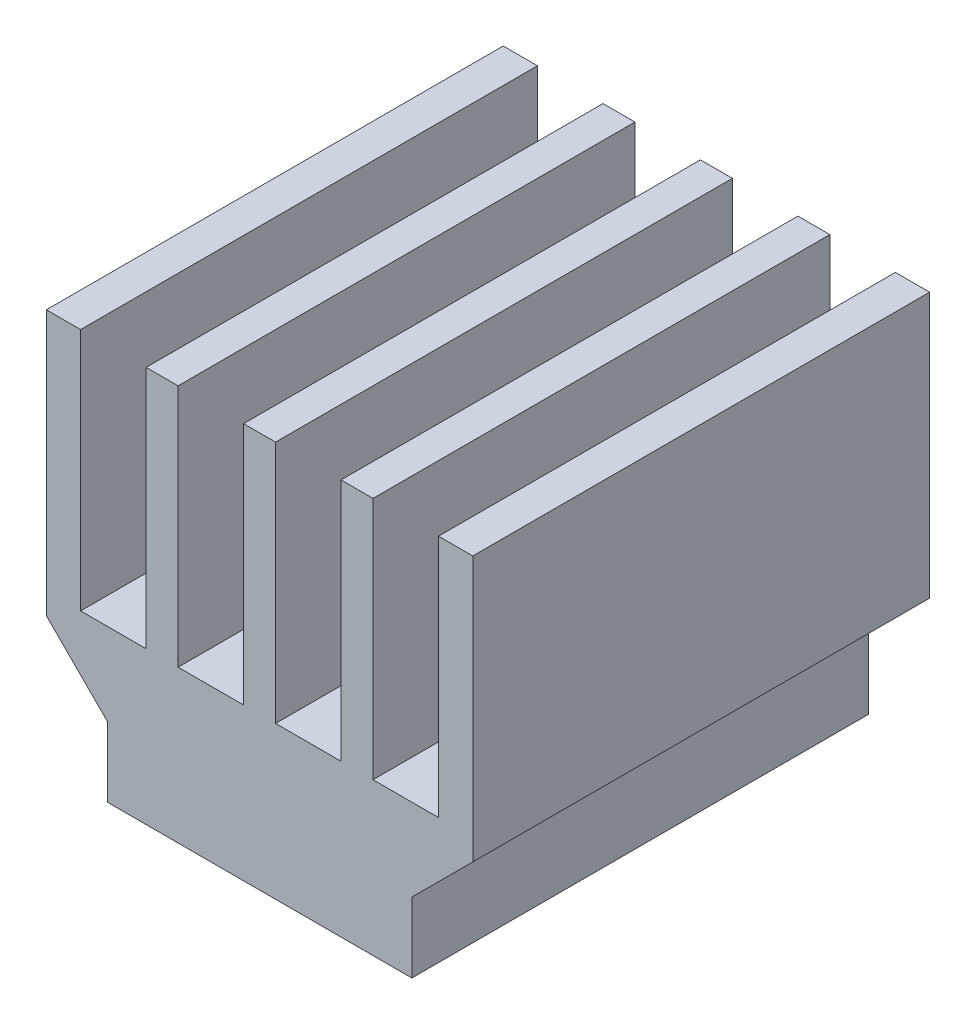
ISO-10303-21;
HEADER;
FILE_DESCRIPTION(('STEP AP214'),'2;1');
FILE_NAME('part.step','',(''),(''),'','','');
FILE_SCHEMA(('AUTOMOTIVE_DESIGN { 1 0 10303 214 1 1 1 1 }'));
ENDSEC;
DATA;
#1=APPLICATION_CONTEXT('core data for automotive mechanical design processes');
#2=APPLICATION_PROTOCOL_DEFINITION('international standard','automotive_design',2000,#1);
#3=PRODUCT_CONTEXT('',#1,'mechanical');
#4=PRODUCT('Part','Part','',(#3));
#5=PRODUCT_RELATED_PRODUCT_CATEGORY('part','',(#4));
#6=PRODUCT_DEFINITION_FORMATION('','',#4);
#7=PRODUCT_DEFINITION_CONTEXT('part definition',#1,'design');
#8=PRODUCT_DEFINITION('design','',#6,#7);
#9=PRODUCT_DEFINITION_SHAPE('','',#8);
#10=(LENGTH_UNIT() NAMED_UNIT(*) SI_UNIT(.MILLI.,.METRE.));
#11=(NAMED_UNIT(*) PLANE_ANGLE_UNIT() SI_UNIT($,.RADIAN.));
#12=(NAMED_UNIT(*) SI_UNIT($,.STERADIAN.) SOLID_ANGLE_UNIT());
#13=UNCERTAINTY_MEASURE_WITH_UNIT(LENGTH_MEASURE(1.E-05),#10,'distance_accuracy_value','');
#14=(GEOMETRIC_REPRESENTATION_CONTEXT(3) GLOBAL_UNCERTAINTY_ASSIGNED_CONTEXT((#13)) GLOBAL_UNIT_ASSIGNED_CONTEXT((#10,
#11,#12)) REPRESENTATION_CONTEXT('',''));
#15=CARTESIAN_POINT('',(0.,0.,0.));
#16=DIRECTION('',(0.,0.,1.));
#17=DIRECTION('',(1.,0.,0.));
#18=AXIS2_PLACEMENT_3D('',#15,#16,#17);
#19=CARTESIAN_POINT('',(-7.,0.,15.));
#20=DIRECTION('',(1.,0.,0.));
#21=DIRECTION('',(0.,1.,0.));
#22=AXIS2_PLACEMENT_3D('',#19,#20,#21);
#23=PLANE('',#22);
#24=DIRECTION('',(0.,-1.,0.));
#25=VECTOR('',#24,1.);
#26=CARTESIAN_POINT('',(-7.,0.,0.));
#27=LINE('',#26,#25);
#28=CARTESIAN_POINT('',(-7.,13.,0.));
#29=VERTEX_POINT('',#28);
#30=CARTESIAN_POINT('',(-7.,4.3,0.));
#31=VERTEX_POINT('',#30);
#32=EDGE_CURVE('E233',#29,#31,#27,.T.);
#33=ORIENTED_EDGE('',*,*,#32,.T.);
#34=DIRECTION('',(0.,0.,-1.));
#35=VECTOR('',#34,1.);
#36=CARTESIAN_POINT('',(-7.,4.3,15.));
#37=LINE('',#36,#35);
#38=CARTESIAN_POINT('',(-7.,4.3,15.));
#39=VERTEX_POINT('',#38);
#40=EDGE_CURVE('E11',#39,#31,#37,.T.);
#41=ORIENTED_EDGE('',*,*,#40,.F.);
#42=DIRECTION('',(0.,-1.,0.));
#43=VECTOR('',#42,1.);
#44=CARTESIAN_POINT('',(-7.,0.,15.));
#45=LINE('',#44,#43);
#46=CARTESIAN_POINT('',(-7.,13.,15.));
#47=VERTEX_POINT('',#46);
#48=EDGE_CURVE('E424',#47,#39,#45,.T.);
#49=ORIENTED_EDGE('',*,*,#48,.F.);
#50=DIRECTION('',(0.,0.,-1.));
#51=VECTOR('',#50,1.);
#52=CARTESIAN_POINT('',(-7.,13.,15.));
#53=LINE('',#52,#51);
#54=EDGE_CURVE('E52',#47,#29,#53,.T.);
#55=ORIENTED_EDGE('',*,*,#54,.T.);
#56=EDGE_LOOP('',(#33,#41,#49,#55));
#57=FACE_BOUND('',#56,.T.);
#58=ADVANCED_FACE('F36',(#57),#23,.F.);
#59=CARTESIAN_POINT('',(-1.34999999999999,-1.34999999999999,15.));
#60=DIRECTION('',(0.707106781186546,0.707106781186549,0.));
#61=DIRECTION('',(-0.707106781186549,0.707106781186546,0.));
#62=AXIS2_PLACEMENT_3D('',#59,#60,#61);
#63=PLANE('',#62);
#64=DIRECTION('',(0.707106781186549,-0.707106781186546,0.));
#65=VECTOR('',#64,1.);
#66=CARTESIAN_POINT('',(-1.34999999999999,-1.34999999999999,0.));
#67=LINE('',#66,#65);
#68=CARTESIAN_POINT('',(-5.,2.30000000000001,0.));
#69=VERTEX_POINT('',#68);
#70=EDGE_CURVE('E235',#31,#69,#67,.T.);
#71=ORIENTED_EDGE('',*,*,#70,.T.);
#72=DIRECTION('',(0.,0.,-1.));
#73=VECTOR('',#72,1.);
#74=CARTESIAN_POINT('',(-5.,2.30000000000001,15.));
#75=LINE('',#74,#73);
#76=CARTESIAN_POINT('',(-5.,2.30000000000001,15.));
#77=VERTEX_POINT('',#76);
#78=EDGE_CURVE('E44',#77,#69,#75,.T.);
#79=ORIENTED_EDGE('',*,*,#78,.F.);
#80=DIRECTION('',(0.707106781186549,-0.707106781186546,0.));
#81=VECTOR('',#80,1.);
#82=CARTESIAN_POINT('',(-1.34999999999999,-1.34999999999999,15.));
#83=LINE('',#82,#81);
#84=EDGE_CURVE('E138',#39,#77,#83,.T.);
#85=ORIENTED_EDGE('',*,*,#84,.F.);
#86=ORIENTED_EDGE('',*,*,#40,.T.);
#87=EDGE_LOOP('',(#71,#79,#85,#86));
#88=FACE_BOUND('',#87,.T.);
#89=ADVANCED_FACE('F427',(#88),#63,.F.);
#90=CARTESIAN_POINT('',(-5.,0.,15.));
#91=DIRECTION('',(1.,0.,0.));
#92=DIRECTION('',(0.,1.,0.));
#93=AXIS2_PLACEMENT_3D('',#90,#91,#92);
#94=PLANE('',#93);
#95=DIRECTION('',(0.,-1.,0.));
#96=VECTOR('',#95,1.);
#97=CARTESIAN_POINT('',(-5.,0.,0.));
#98=LINE('',#97,#96);
#99=CARTESIAN_POINT('',(-5.,0.,0.));
#100=VERTEX_POINT('',#99);
#101=EDGE_CURVE('E237',#69,#100,#98,.T.);
#102=ORIENTED_EDGE('',*,*,#101,.T.);
#103=DIRECTION('',(0.,0.,-1.));
#104=VECTOR('',#103,1.);
#105=CARTESIAN_POINT('',(-5.,0.,15.));
#106=LINE('',#105,#104);
#107=CARTESIAN_POINT('',(-5.,0.,15.));
#108=VERTEX_POINT('',#107);
#109=EDGE_CURVE('E335',#108,#100,#106,.T.);
#110=ORIENTED_EDGE('',*,*,#109,.F.);
#111=DIRECTION('',(0.,-1.,0.));
#112=VECTOR('',#111,1.);
#113=CARTESIAN_POINT('',(-5.,0.,15.));
#114=LINE('',#113,#112);
#115=EDGE_CURVE('E343',#77,#108,#114,.T.);
#116=ORIENTED_EDGE('',*,*,#115,.F.);
#117=ORIENTED_EDGE('',*,*,#78,.T.);
#118=EDGE_LOOP('',(#102,#110,#116,#117));
#119=FACE_BOUND('',#118,.T.);
#120=ADVANCED_FACE('F341',(#119),#94,.F.);
#121=CARTESIAN_POINT('',(0.,0.,15.));
#122=DIRECTION('',(0.,1.,0.));
#123=DIRECTION('',(0.,0.,1.));
#124=AXIS2_PLACEMENT_3D('',#121,#122,#123);
#125=PLANE('',#124);
#126=DIRECTION('',(1.,0.,0.));
#127=VECTOR('',#126,1.);
#128=CARTESIAN_POINT('',(0.,0.,0.));
#129=LINE('',#128,#127);
#130=CARTESIAN_POINT('',(5.,0.,0.));
#131=VERTEX_POINT('',#130);
#132=EDGE_CURVE('E240',#100,#131,#129,.T.);
#133=ORIENTED_EDGE('',*,*,#132,.T.);
#134=DIRECTION('',(0.,0.,-1.));
#135=VECTOR('',#134,1.);
#136=CARTESIAN_POINT('',(5.,0.,15.));
#137=LINE('',#136,#135);
#138=CARTESIAN_POINT('',(5.,0.,15.));
#139=VERTEX_POINT('',#138);
#140=EDGE_CURVE('E332',#139,#131,#137,.T.);
#141=ORIENTED_EDGE('',*,*,#140,.F.);
#142=DIRECTION('',(1.,0.,0.));
#143=VECTOR('',#142,1.);
#144=CARTESIAN_POINT('',(0.,0.,15.));
#145=LINE('',#144,#143);
#146=EDGE_CURVE('E353',#108,#139,#145,.T.);
#147=ORIENTED_EDGE('',*,*,#146,.F.);
#148=ORIENTED_EDGE('',*,*,#109,.T.);
#149=EDGE_LOOP('',(#133,#141,#147,#148));
#150=FACE_BOUND('',#149,.T.);
#151=ADVANCED_FACE('F350',(#150),#125,.F.);
#152=CARTESIAN_POINT('',(5.,0.,15.));
#153=DIRECTION('',(1.,0.,0.));
#154=DIRECTION('',(0.,1.,0.));
#155=AXIS2_PLACEMENT_3D('',#152,#153,#154);
#156=PLANE('',#155);
#157=DIRECTION('',(0.,-1.,0.));
#158=VECTOR('',#157,1.);
#159=CARTESIAN_POINT('',(5.,0.,0.));
#160=LINE('',#159,#158);
#161=CARTESIAN_POINT('',(5.,2.30000000000001,0.));
#162=VERTEX_POINT('',#161);
#163=EDGE_CURVE('E243',#162,#131,#160,.T.);
#164=ORIENTED_EDGE('',*,*,#163,.F.);
#165=DIRECTION('',(0.,0.,-1.));
#166=VECTOR('',#165,1.);
#167=CARTESIAN_POINT('',(5.,2.30000000000001,15.));
#168=LINE('',#167,#166);
#169=CARTESIAN_POINT('',(5.,2.30000000000001,15.));
#170=VERTEX_POINT('',#169);
#171=EDGE_CURVE('E330',#170,#162,#168,.T.);
#172=ORIENTED_EDGE('',*,*,#171,.F.);
#173=DIRECTION('',(0.,-1.,0.));
#174=VECTOR('',#173,1.);
#175=CARTESIAN_POINT('',(5.,0.,15.));
#176=LINE('',#175,#174);
#177=EDGE_CURVE('E356',#170,#139,#176,.T.);
#178=ORIENTED_EDGE('',*,*,#177,.T.);
#179=ORIENTED_EDGE('',*,*,#140,.T.);
#180=EDGE_LOOP('',(#164,#172,#178,#179));
#181=FACE_BOUND('',#180,.T.);
#182=ADVANCED_FACE('F437',(#181),#156,.T.);
#183=CARTESIAN_POINT('',(1.34999999999999,-1.34999999999999,15.));
#184=DIRECTION('',(0.707106781186546,-0.707106781186549,0.));
#185=DIRECTION('',(0.707106781186549,0.707106781186546,0.));
#186=AXIS2_PLACEMENT_3D('',#183,#184,#185);
#187=PLANE('',#186);
#188=DIRECTION('',(-0.707106781186549,-0.707106781186546,0.));
#189=VECTOR('',#188,1.);
#190=CARTESIAN_POINT('',(1.34999999999999,-1.34999999999999,0.));
#191=LINE('',#190,#189);
#192=CARTESIAN_POINT('',(7.,4.3,0.));
#193=VERTEX_POINT('',#192);
#194=EDGE_CURVE('E246',#193,#162,#191,.T.);
#195=ORIENTED_EDGE('',*,*,#194,.F.);
#196=DIRECTION('',(0.,0.,-1.));
#197=VECTOR('',#196,1.);
#198=CARTESIAN_POINT('',(7.,4.3,15.));
#199=LINE('',#198,#197);
#200=CARTESIAN_POINT('',(7.,4.3,15.));
#201=VERTEX_POINT('',#200);
#202=EDGE_CURVE('E327',#201,#193,#199,.T.);
#203=ORIENTED_EDGE('',*,*,#202,.F.);
#204=DIRECTION('',(-0.707106781186549,-0.707106781186546,0.));
#205=VECTOR('',#204,1.);
#206=CARTESIAN_POINT('',(1.34999999999999,-1.34999999999999,15.));
#207=LINE('',#206,#205);
#208=EDGE_CURVE('E360',#201,#170,#207,.T.);
#209=ORIENTED_EDGE('',*,*,#208,.T.);
#210=ORIENTED_EDGE('',*,*,#171,.T.);
#211=EDGE_LOOP('',(#195,#203,#209,#210));
#212=FACE_BOUND('',#211,.T.);
#213=ADVANCED_FACE('F440',(#212),#187,.T.);
#214=CARTESIAN_POINT('',(7.,0.,15.));
#215=DIRECTION('',(1.,0.,0.));
#216=DIRECTION('',(0.,1.,0.));
#217=AXIS2_PLACEMENT_3D('',#214,#215,#216);
#218=PLANE('',#217);
#219=DIRECTION('',(0.,-1.,0.));
#220=VECTOR('',#219,1.);
#221=CARTESIAN_POINT('',(7.,0.,0.));
#222=LINE('',#221,#220);
#223=CARTESIAN_POINT('',(7.,13.,0.));
#224=VERTEX_POINT('',#223);
#225=EDGE_CURVE('E249',#224,#193,#222,.T.);
#226=ORIENTED_EDGE('',*,*,#225,.F.);
#227=DIRECTION('',(0.,0.,-1.));
#228=VECTOR('',#227,1.);
#229=CARTESIAN_POINT('',(7.,13.,15.));
#230=LINE('',#229,#228);
#231=CARTESIAN_POINT('',(7.,13.,15.));
#232=VERTEX_POINT('',#231);
#233=EDGE_CURVE('E325',#232,#224,#230,.T.);
#234=ORIENTED_EDGE('',*,*,#233,.F.);
#235=DIRECTION('',(0.,-1.,0.));
#236=VECTOR('',#235,1.);
#237=CARTESIAN_POINT('',(7.,0.,15.));
#238=LINE('',#237,#236);
#239=EDGE_CURVE('E367',#232,#201,#238,.T.);
#240=ORIENTED_EDGE('',*,*,#239,.T.);
#241=ORIENTED_EDGE('',*,*,#202,.T.);
#242=EDGE_LOOP('',(#226,#234,#240,#241));
#243=FACE_BOUND('',#242,.T.);
#244=ADVANCED_FACE('F444',(#243),#218,.T.);
#245=CARTESIAN_POINT('',(0.,13.,15.));
#246=DIRECTION('',(0.,1.,0.));
#247=DIRECTION('',(0.,0.,1.));
#248=AXIS2_PLACEMENT_3D('',#245,#246,#247);
#249=PLANE('',#248);
#250=DIRECTION('',(1.,0.,0.));
#251=VECTOR('',#250,1.);
#252=CARTESIAN_POINT('',(0.,13.,0.));
#253=LINE('',#252,#251);
#254=CARTESIAN_POINT('',(5.875,13.,0.));
#255=VERTEX_POINT('',#254);
#256=EDGE_CURVE('E253',#255,#224,#253,.T.);
#257=ORIENTED_EDGE('',*,*,#256,.F.);
#258=DIRECTION('',(0.,0.,-1.));
#259=VECTOR('',#258,1.);
#260=CARTESIAN_POINT('',(5.875,13.,15.));
#261=LINE('',#260,#259);
#262=CARTESIAN_POINT('',(5.875,13.,15.));
#263=VERTEX_POINT('',#262);
#264=EDGE_CURVE('E323',#263,#255,#261,.T.);
#265=ORIENTED_EDGE('',*,*,#264,.F.);
#266=DIRECTION('',(1.,0.,0.));
#267=VECTOR('',#266,1.);
#268=CARTESIAN_POINT('',(0.,13.,15.));
#269=LINE('',#268,#267);
#270=EDGE_CURVE('E230',#263,#232,#269,.T.);
#271=ORIENTED_EDGE('',*,*,#270,.T.);
#272=ORIENTED_EDGE('',*,*,#233,.T.);
#273=EDGE_LOOP('',(#257,#265,#271,#272));
#274=FACE_BOUND('',#273,.T.);
#275=ADVANCED_FACE('F448',(#274),#249,.T.);
#276=CARTESIAN_POINT('',(5.875,0.,15.));
#277=DIRECTION('',(1.,0.,0.));
#278=DIRECTION('',(0.,1.,0.));
#279=AXIS2_PLACEMENT_3D('',#276,#277,#278);
#280=PLANE('',#279);
#281=DIRECTION('',(0.,-1.,0.));
#282=VECTOR('',#281,1.);
#283=CARTESIAN_POINT('',(5.875,0.,0.));
#284=LINE('',#283,#282);
#285=CARTESIAN_POINT('',(5.875,5.,0.));
#286=VERTEX_POINT('',#285);
#287=EDGE_CURVE('E256',#255,#286,#284,.T.);
#288=ORIENTED_EDGE('',*,*,#287,.T.);
#289=DIRECTION('',(0.,0.,-1.));
#290=VECTOR('',#289,1.);
#291=CARTESIAN_POINT('',(5.875,5.,15.));
#292=LINE('',#291,#290);
#293=CARTESIAN_POINT('',(5.875,5.,15.));
#294=VERTEX_POINT('',#293);
#295=EDGE_CURVE('E320',#294,#286,#292,.T.);
#296=ORIENTED_EDGE('',*,*,#295,.F.);
#297=DIRECTION('',(0.,-1.,0.));
#298=VECTOR('',#297,1.);
#299=CARTESIAN_POINT('',(5.875,0.,15.));
#300=LINE('',#299,#298);
#301=EDGE_CURVE('E371',#263,#294,#300,.T.);
#302=ORIENTED_EDGE('',*,*,#301,.F.);
#303=ORIENTED_EDGE('',*,*,#264,.T.);
#304=EDGE_LOOP('',(#288,#296,#302,#303));
#305=FACE_BOUND('',#304,.T.);
#306=ADVANCED_FACE('F450',(#305),#280,.F.);
#307=CARTESIAN_POINT('',(0.,5.,15.));
#308=DIRECTION('',(0.,1.,0.));
#309=DIRECTION('',(0.,0.,1.));
#310=AXIS2_PLACEMENT_3D('',#307,#308,#309);
#311=PLANE('',#310);
#312=DIRECTION('',(1.,0.,0.));
#313=VECTOR('',#312,1.);
#314=CARTESIAN_POINT('',(0.,5.,0.));
#315=LINE('',#314,#313);
#316=CARTESIAN_POINT('',(3.725,5.,0.));
#317=VERTEX_POINT('',#316);
#318=EDGE_CURVE('E261',#317,#286,#315,.T.);
#319=ORIENTED_EDGE('',*,*,#318,.F.);
#320=DIRECTION('',(0.,0.,-1.));
#321=VECTOR('',#320,1.);
#322=CARTESIAN_POINT('',(3.725,5.,15.));
#323=LINE('',#322,#321);
#324=CARTESIAN_POINT('',(3.725,5.,15.));
#325=VERTEX_POINT('',#324);
#326=EDGE_CURVE('E318',#325,#317,#323,.T.);
#327=ORIENTED_EDGE('',*,*,#326,.F.);
#328=DIRECTION('',(1.,0.,0.));
#329=VECTOR('',#328,1.);
#330=CARTESIAN_POINT('',(0.,5.,15.));
#331=LINE('',#330,#329);
#332=EDGE_CURVE('E374',#325,#294,#331,.T.);
#333=ORIENTED_EDGE('',*,*,#332,.T.);
#334=ORIENTED_EDGE('',*,*,#295,.T.);
#335=EDGE_LOOP('',(#319,#327,#333,#334));
#336=FACE_BOUND('',#335,.T.);
#337=ADVANCED_FACE('F453',(#336),#311,.T.);
#338=CARTESIAN_POINT('',(3.725,0.,15.));
#339=DIRECTION('',(1.,0.,0.));
#340=DIRECTION('',(0.,1.,0.));
#341=AXIS2_PLACEMENT_3D('',#338,#339,#340);
#342=PLANE('',#341);
#343=DIRECTION('',(0.,-1.,0.));
#344=VECTOR('',#343,1.);
#345=CARTESIAN_POINT('',(3.725,0.,0.));
#346=LINE('',#345,#344);
#347=CARTESIAN_POINT('',(3.725,13.,0.));
#348=VERTEX_POINT('',#347);
#349=EDGE_CURVE('E264',#348,#317,#346,.T.);
#350=ORIENTED_EDGE('',*,*,#349,.F.);
#351=DIRECTION('',(0.,0.,-1.));
#352=VECTOR('',#351,1.);
#353=CARTESIAN_POINT('',(3.725,13.,15.));
#354=LINE('',#353,#352);
#355=CARTESIAN_POINT('',(3.725,13.,15.));
#356=VERTEX_POINT('',#355);
#357=EDGE_CURVE('E316',#356,#348,#354,.T.);
#358=ORIENTED_EDGE('',*,*,#357,.F.);
#359=DIRECTION('',(0.,-1.,0.));
#360=VECTOR('',#359,1.);
#361=CARTESIAN_POINT('',(3.725,0.,15.));
#362=LINE('',#361,#360);
#363=EDGE_CURVE('E377',#356,#325,#362,.T.);
#364=ORIENTED_EDGE('',*,*,#363,.T.);
#365=ORIENTED_EDGE('',*,*,#326,.T.);
#366=EDGE_LOOP('',(#350,#358,#364,#365));
#367=FACE_BOUND('',#366,.T.);
#368=ADVANCED_FACE('F413',(#367),#342,.T.);
#369=CARTESIAN_POINT('',(2.675,13.,0.));
#370=VERTEX_POINT('',#369);
#371=EDGE_CURVE('E258',#370,#348,#253,.T.);
#372=ORIENTED_EDGE('',*,*,#371,.F.);
#373=DIRECTION('',(0.,0.,-1.));
#374=VECTOR('',#373,1.);
#375=CARTESIAN_POINT('',(2.675,13.,15.));
#376=LINE('',#375,#374);
#377=CARTESIAN_POINT('',(2.675,13.,15.));
#378=VERTEX_POINT('',#377);
#379=EDGE_CURVE('E314',#378,#370,#376,.T.);
#380=ORIENTED_EDGE('',*,*,#379,.F.);
#381=EDGE_CURVE('E372',#378,#356,#269,.T.);
#382=ORIENTED_EDGE('',*,*,#381,.T.);
#383=ORIENTED_EDGE('',*,*,#357,.T.);
#384=EDGE_LOOP('',(#372,#380,#382,#383));
#385=FACE_BOUND('',#384,.T.);
#386=ADVANCED_FACE('F405',(#385),#249,.T.);
#387=CARTESIAN_POINT('',(2.675,0.,15.));
#388=DIRECTION('',(1.,0.,0.));
#389=DIRECTION('',(0.,1.,0.));
#390=AXIS2_PLACEMENT_3D('',#387,#388,#389);
#391=PLANE('',#390);
#392=DIRECTION('',(0.,-1.,0.));
#393=VECTOR('',#392,1.);
#394=CARTESIAN_POINT('',(2.675,0.,0.));
#395=LINE('',#394,#393);
#396=CARTESIAN_POINT('',(2.675,5.,0.));
#397=VERTEX_POINT('',#396);
#398=EDGE_CURVE('E268',#370,#397,#395,.T.);
#399=ORIENTED_EDGE('',*,*,#398,.T.);
#400=DIRECTION('',(0.,0.,-1.));
#401=VECTOR('',#400,1.);
#402=CARTESIAN_POINT('',(2.675,5.,15.));
#403=LINE('',#402,#401);
#404=CARTESIAN_POINT('',(2.675,5.,15.));
#405=VERTEX_POINT('',#404);
#406=EDGE_CURVE('E311',#405,#397,#403,.T.);
#407=ORIENTED_EDGE('',*,*,#406,.F.);
#408=DIRECTION('',(0.,-1.,0.));
#409=VECTOR('',#408,1.);
#410=CARTESIAN_POINT('',(2.675,0.,15.));
#411=LINE('',#410,#409);
#412=EDGE_CURVE('E380',#378,#405,#411,.T.);
#413=ORIENTED_EDGE('',*,*,#412,.F.);
#414=ORIENTED_EDGE('',*,*,#379,.T.);
#415=EDGE_LOOP('',(#399,#407,#413,#414));
#416=FACE_BOUND('',#415,.T.);
#417=ADVANCED_FACE('F460',(#416),#391,.F.);
#418=CARTESIAN_POINT('',(0.,5.,15.));
#419=DIRECTION('',(0.,1.,0.));
#420=DIRECTION('',(0.,0.,1.));
#421=AXIS2_PLACEMENT_3D('',#418,#419,#420);
#422=PLANE('',#421);
#423=DIRECTION('',(1.,0.,0.));
#424=VECTOR('',#423,1.);
#425=CARTESIAN_POINT('',(0.,5.,0.));
#426=LINE('',#425,#424);
#427=CARTESIAN_POINT('',(0.525000000000001,5.,0.));
#428=VERTEX_POINT('',#427);
#429=EDGE_CURVE('E271',#428,#397,#426,.T.);
#430=ORIENTED_EDGE('',*,*,#429,.F.);
#431=DIRECTION('',(0.,0.,-1.));
#432=VECTOR('',#431,1.);
#433=CARTESIAN_POINT('',(0.525000000000001,5.,15.));
#434=LINE('',#433,#432);
#435=CARTESIAN_POINT('',(0.525000000000001,5.,15.));
#436=VERTEX_POINT('',#435);
#437=EDGE_CURVE('E309',#436,#428,#434,.T.);
#438=ORIENTED_EDGE('',*,*,#437,.F.);
#439=DIRECTION('',(1.,0.,0.));
#440=VECTOR('',#439,1.);
#441=CARTESIAN_POINT('',(0.,5.,15.));
#442=LINE('',#441,#440);
#443=EDGE_CURVE('E382',#436,#405,#442,.T.);
#444=ORIENTED_EDGE('',*,*,#443,.T.);
#445=ORIENTED_EDGE('',*,*,#406,.T.);
#446=EDGE_LOOP('',(#430,#438,#444,#445));
#447=FACE_BOUND('',#446,.T.);
#448=ADVANCED_FACE('F463',(#447),#422,.T.);
#449=CARTESIAN_POINT('',(0.525000000000002,0.,15.));
#450=DIRECTION('',(1.,0.,0.));
#451=DIRECTION('',(0.,1.,0.));
#452=AXIS2_PLACEMENT_3D('',#449,#450,#451);
#453=PLANE('',#452);
#454=DIRECTION('',(0.,-1.,0.));
#455=VECTOR('',#454,1.);
#456=CARTESIAN_POINT('',(0.525000000000002,0.,0.));
#457=LINE('',#456,#455);
#458=CARTESIAN_POINT('',(0.525,13.,0.));
#459=VERTEX_POINT('',#458);
#460=EDGE_CURVE('E274',#459,#428,#457,.T.);
#461=ORIENTED_EDGE('',*,*,#460,.F.);
#462=DIRECTION('',(0.,0.,-1.));
#463=VECTOR('',#462,1.);
#464=CARTESIAN_POINT('',(0.525,13.,15.));
#465=LINE('',#464,#463);
#466=CARTESIAN_POINT('',(0.525,13.,15.));
#467=VERTEX_POINT('',#466);
#468=EDGE_CURVE('E307',#467,#459,#465,.T.);
#469=ORIENTED_EDGE('',*,*,#468,.F.);
#470=DIRECTION('',(0.,-1.,0.));
#471=VECTOR('',#470,1.);
#472=CARTESIAN_POINT('',(0.525000000000002,0.,15.));
#473=LINE('',#472,#471);
#474=EDGE_CURVE('E386',#467,#436,#473,.T.);
#475=ORIENTED_EDGE('',*,*,#474,.T.);
#476=ORIENTED_EDGE('',*,*,#437,.T.);
#477=EDGE_LOOP('',(#461,#469,#475,#476));
#478=FACE_BOUND('',#477,.T.);
#479=ADVANCED_FACE('F467',(#478),#453,.T.);
#480=CARTESIAN_POINT('',(-0.525,13.,0.));
#481=VERTEX_POINT('',#480);
#482=EDGE_CURVE('E277',#481,#459,#253,.T.);
#483=ORIENTED_EDGE('',*,*,#482,.F.);
#484=DIRECTION('',(0.,0.,-1.));
#485=VECTOR('',#484,1.);
#486=CARTESIAN_POINT('',(-0.525,13.,15.));
#487=LINE('',#486,#485);
#488=CARTESIAN_POINT('',(-0.525,13.,15.));
#489=VERTEX_POINT('',#488);
#490=EDGE_CURVE('E305',#489,#481,#487,.T.);
#491=ORIENTED_EDGE('',*,*,#490,.F.);
#492=EDGE_CURVE('E389',#489,#467,#269,.T.);
#493=ORIENTED_EDGE('',*,*,#492,.T.);
#494=ORIENTED_EDGE('',*,*,#468,.T.);
#495=EDGE_LOOP('',(#483,#491,#493,#494));
#496=FACE_BOUND('',#495,.T.);
#497=ADVANCED_FACE('F471',(#496),#249,.T.);
#498=CARTESIAN_POINT('',(-0.525000000000002,0.,15.));
#499=DIRECTION('',(1.,0.,0.));
#500=DIRECTION('',(0.,1.,0.));
#501=AXIS2_PLACEMENT_3D('',#498,#499,#500);
#502=PLANE('',#501);
#503=DIRECTION('',(0.,-1.,0.));
#504=VECTOR('',#503,1.);
#505=CARTESIAN_POINT('',(-0.525000000000002,0.,0.));
#506=LINE('',#505,#504);
#507=CARTESIAN_POINT('',(-0.525000000000001,5.,0.));
#508=VERTEX_POINT('',#507);
#509=EDGE_CURVE('E278',#481,#508,#506,.T.);
#510=ORIENTED_EDGE('',*,*,#509,.T.);
#511=DIRECTION('',(0.,0.,-1.));
#512=VECTOR('',#511,1.);
#513=CARTESIAN_POINT('',(-0.525000000000001,5.,15.));
#514=LINE('',#513,#512);
#515=CARTESIAN_POINT('',(-0.525000000000001,5.,15.));
#516=VERTEX_POINT('',#515);
#517=EDGE_CURVE('E302',#516,#508,#514,.T.);
#518=ORIENTED_EDGE('',*,*,#517,.F.);
#519=DIRECTION('',(0.,-1.,0.));
#520=VECTOR('',#519,1.);
#521=CARTESIAN_POINT('',(-0.525000000000002,0.,15.));
#522=LINE('',#521,#520);
#523=EDGE_CURVE('E390',#489,#516,#522,.T.);
#524=ORIENTED_EDGE('',*,*,#523,.F.);
#525=ORIENTED_EDGE('',*,*,#490,.T.);
#526=EDGE_LOOP('',(#510,#518,#524,#525));
#527=FACE_BOUND('',#526,.T.);
#528=ADVANCED_FACE('F473',(#527),#502,.F.);
#529=CARTESIAN_POINT('',(0.,5.,15.));
#530=DIRECTION('',(0.,-1.,0.));
#531=DIRECTION('',(0.,0.,-1.));
#532=AXIS2_PLACEMENT_3D('',#529,#530,#531);
#533=PLANE('',#532);
#534=DIRECTION('',(-1.,0.,0.));
#535=VECTOR('',#534,1.);
#536=CARTESIAN_POINT('',(0.,5.,0.));
#537=LINE('',#536,#535);
#538=CARTESIAN_POINT('',(-2.675,5.,0.));
#539=VERTEX_POINT('',#538);
#540=EDGE_CURVE('E280',#508,#539,#537,.T.);
#541=ORIENTED_EDGE('',*,*,#540,.T.);
#542=DIRECTION('',(0.,0.,-1.));
#543=VECTOR('',#542,1.);
#544=CARTESIAN_POINT('',(-2.675,5.,15.));
#545=LINE('',#544,#543);
#546=CARTESIAN_POINT('',(-2.675,5.,15.));
#547=VERTEX_POINT('',#546);
#548=EDGE_CURVE('E300',#547,#539,#545,.T.);
#549=ORIENTED_EDGE('',*,*,#548,.F.);
#550=DIRECTION('',(-1.,0.,0.));
#551=VECTOR('',#550,1.);
#552=CARTESIAN_POINT('',(0.,5.,15.));
#553=LINE('',#552,#551);
#554=EDGE_CURVE('E392',#516,#547,#553,.T.);
#555=ORIENTED_EDGE('',*,*,#554,.F.);
#556=ORIENTED_EDGE('',*,*,#517,.T.);
#557=EDGE_LOOP('',(#541,#549,#555,#556));
#558=FACE_BOUND('',#557,.T.);
#559=ADVANCED_FACE('F476',(#558),#533,.F.);
#560=CARTESIAN_POINT('',(-2.675,0.,15.));
#561=DIRECTION('',(1.,0.,0.));
#562=DIRECTION('',(0.,1.,0.));
#563=AXIS2_PLACEMENT_3D('',#560,#561,#562);
#564=PLANE('',#563);
#565=DIRECTION('',(0.,-1.,0.));
#566=VECTOR('',#565,1.);
#567=CARTESIAN_POINT('',(-2.675,0.,0.));
#568=LINE('',#567,#566);
#569=CARTESIAN_POINT('',(-2.675,13.,0.));
#570=VERTEX_POINT('',#569);
#571=EDGE_CURVE('E283',#570,#539,#568,.T.);
#572=ORIENTED_EDGE('',*,*,#571,.F.);
#573=DIRECTION('',(0.,0.,-1.));
#574=VECTOR('',#573,1.);
#575=CARTESIAN_POINT('',(-2.675,13.,15.));
#576=LINE('',#575,#574);
#577=CARTESIAN_POINT('',(-2.675,13.,15.));
#578=VERTEX_POINT('',#577);
#579=EDGE_CURVE('E298',#578,#570,#576,.T.);
#580=ORIENTED_EDGE('',*,*,#579,.F.);
#581=DIRECTION('',(0.,-1.,0.));
#582=VECTOR('',#581,1.);
#583=CARTESIAN_POINT('',(-2.675,0.,15.));
#584=LINE('',#583,#582);
#585=EDGE_CURVE('E394',#578,#547,#584,.T.);
#586=ORIENTED_EDGE('',*,*,#585,.T.);
#587=ORIENTED_EDGE('',*,*,#548,.T.);
#588=EDGE_LOOP('',(#572,#580,#586,#587));
#589=FACE_BOUND('',#588,.T.);
#590=ADVANCED_FACE('F480',(#589),#564,.T.);
#591=CARTESIAN_POINT('',(-3.725,13.,0.));
#592=VERTEX_POINT('',#591);
#593=EDGE_CURVE('E286',#592,#570,#253,.T.);
#594=ORIENTED_EDGE('',*,*,#593,.F.);
#595=DIRECTION('',(0.,0.,-1.));
#596=VECTOR('',#595,1.);
#597=CARTESIAN_POINT('',(-3.725,13.,15.));
#598=LINE('',#597,#596);
#599=CARTESIAN_POINT('',(-3.725,13.,15.));
#600=VERTEX_POINT('',#599);
#601=EDGE_CURVE('E296',#600,#592,#598,.T.);
#602=ORIENTED_EDGE('',*,*,#601,.F.);
#603=EDGE_CURVE('E229',#600,#578,#269,.T.);
#604=ORIENTED_EDGE('',*,*,#603,.T.);
#605=ORIENTED_EDGE('',*,*,#579,.T.);
#606=EDGE_LOOP('',(#594,#602,#604,#605));
#607=FACE_BOUND('',#606,.T.);
#608=ADVANCED_FACE('F484',(#607),#249,.T.);
#609=CARTESIAN_POINT('',(-3.725,0.,15.));
#610=DIRECTION('',(1.,0.,0.));
#611=DIRECTION('',(0.,1.,0.));
#612=AXIS2_PLACEMENT_3D('',#609,#610,#611);
#613=PLANE('',#612);
#614=DIRECTION('',(0.,-1.,0.));
#615=VECTOR('',#614,1.);
#616=CARTESIAN_POINT('',(-3.725,0.,0.));
#617=LINE('',#616,#615);
#618=CARTESIAN_POINT('',(-3.725,5.,0.));
#619=VERTEX_POINT('',#618);
#620=EDGE_CURVE('E287',#592,#619,#617,.T.);
#621=ORIENTED_EDGE('',*,*,#620,.T.);
#622=DIRECTION('',(0.,0.,-1.));
#623=VECTOR('',#622,1.);
#624=CARTESIAN_POINT('',(-3.725,5.,15.));
#625=LINE('',#624,#623);
#626=CARTESIAN_POINT('',(-3.725,5.,15.));
#627=VERTEX_POINT('',#626);
#628=EDGE_CURVE('E223',#627,#619,#625,.T.);
#629=ORIENTED_EDGE('',*,*,#628,.F.);
#630=DIRECTION('',(0.,-1.,0.));
#631=VECTOR('',#630,1.);
#632=CARTESIAN_POINT('',(-3.725,0.,15.));
#633=LINE('',#632,#631);
#634=EDGE_CURVE('E210',#600,#627,#633,.T.);
#635=ORIENTED_EDGE('',*,*,#634,.F.);
#636=ORIENTED_EDGE('',*,*,#601,.T.);
#637=EDGE_LOOP('',(#621,#629,#635,#636));
#638=FACE_BOUND('',#637,.T.);
#639=ADVANCED_FACE('F486',(#638),#613,.F.);
#640=CARTESIAN_POINT('',(0.,5.,15.));
#641=DIRECTION('',(0.,-1.,0.));
#642=DIRECTION('',(0.,0.,-1.));
#643=AXIS2_PLACEMENT_3D('',#640,#641,#642);
#644=PLANE('',#643);
#645=DIRECTION('',(-1.,0.,0.));
#646=VECTOR('',#645,1.);
#647=CARTESIAN_POINT('',(0.,5.,0.));
#648=LINE('',#647,#646);
#649=CARTESIAN_POINT('',(-5.875,5.,0.));
#650=VERTEX_POINT('',#649);
#651=EDGE_CURVE('E220',#619,#650,#648,.T.);
#652=ORIENTED_EDGE('',*,*,#651,.T.);
#653=DIRECTION('',(0.,0.,-1.));
#654=VECTOR('',#653,1.);
#655=CARTESIAN_POINT('',(-5.875,5.,15.));
#656=LINE('',#655,#654);
#657=CARTESIAN_POINT('',(-5.875,5.,15.));
#658=VERTEX_POINT('',#657);
#659=EDGE_CURVE('E217',#658,#650,#656,.T.);
#660=ORIENTED_EDGE('',*,*,#659,.F.);
#661=DIRECTION('',(-1.,0.,0.));
#662=VECTOR('',#661,1.);
#663=CARTESIAN_POINT('',(0.,5.,15.));
#664=LINE('',#663,#662);
#665=EDGE_CURVE('E202',#627,#658,#664,.T.);
#666=ORIENTED_EDGE('',*,*,#665,.F.);
#667=ORIENTED_EDGE('',*,*,#628,.T.);
#668=EDGE_LOOP('',(#652,#660,#666,#667));
#669=FACE_BOUND('',#668,.T.);
#670=ADVANCED_FACE('F218',(#669),#644,.F.);
#671=CARTESIAN_POINT('',(-5.875,0.,15.));
#672=DIRECTION('',(1.,0.,0.));
#673=DIRECTION('',(0.,1.,0.));
#674=AXIS2_PLACEMENT_3D('',#671,#672,#673);
#675=PLANE('',#674);
#676=DIRECTION('',(0.,-1.,0.));
#677=VECTOR('',#676,1.);
#678=CARTESIAN_POINT('',(-5.875,0.,0.));
#679=LINE('',#678,#677);
#680=CARTESIAN_POINT('',(-5.875,13.,0.));
#681=VERTEX_POINT('',#680);
#682=EDGE_CURVE('E290',#681,#650,#679,.T.);
#683=ORIENTED_EDGE('',*,*,#682,.F.);
#684=DIRECTION('',(0.,0.,-1.));
#685=VECTOR('',#684,1.);
#686=CARTESIAN_POINT('',(-5.875,13.,15.));
#687=LINE('',#686,#685);
#688=CARTESIAN_POINT('',(-5.875,13.,15.));
#689=VERTEX_POINT('',#688);
#690=EDGE_CURVE('E126',#689,#681,#687,.T.);
#691=ORIENTED_EDGE('',*,*,#690,.F.);
#692=DIRECTION('',(0.,-1.,0.));
#693=VECTOR('',#692,1.);
#694=CARTESIAN_POINT('',(-5.875,0.,15.));
#695=LINE('',#694,#693);
#696=EDGE_CURVE('E207',#689,#658,#695,.T.);
#697=ORIENTED_EDGE('',*,*,#696,.T.);
#698=ORIENTED_EDGE('',*,*,#659,.T.);
#699=EDGE_LOOP('',(#683,#691,#697,#698));
#700=FACE_BOUND('',#699,.T.);
#701=ADVANCED_FACE('F225',(#700),#675,.T.);
#702=EDGE_CURVE('E257',#29,#681,#253,.T.);
#703=ORIENTED_EDGE('',*,*,#702,.F.);
#704=ORIENTED_EDGE('',*,*,#54,.F.);
#705=EDGE_CURVE('E226',#47,#689,#269,.T.);
#706=ORIENTED_EDGE('',*,*,#705,.T.);
#707=ORIENTED_EDGE('',*,*,#690,.T.);
#708=EDGE_LOOP('',(#703,#704,#706,#707));
#709=FACE_BOUND('',#708,.T.);
#710=ADVANCED_FACE('F494',(#709),#249,.T.);
#711=CARTESIAN_POINT('',(0.,0.,15.));
#712=DIRECTION('',(0.,0.,1.));
#713=DIRECTION('',(1.,0.,0.));
#714=AXIS2_PLACEMENT_3D('',#711,#712,#713);
#715=PLANE('',#714);
#716=ORIENTED_EDGE('',*,*,#48,.T.);
#717=ORIENTED_EDGE('',*,*,#84,.T.);
#718=ORIENTED_EDGE('',*,*,#115,.T.);
#719=ORIENTED_EDGE('',*,*,#146,.T.);
#720=ORIENTED_EDGE('',*,*,#177,.F.);
#721=ORIENTED_EDGE('',*,*,#208,.F.);
#722=ORIENTED_EDGE('',*,*,#239,.F.);
#723=ORIENTED_EDGE('',*,*,#270,.F.);
#724=ORIENTED_EDGE('',*,*,#301,.T.);
#725=ORIENTED_EDGE('',*,*,#332,.F.);
#726=ORIENTED_EDGE('',*,*,#363,.F.);
#727=ORIENTED_EDGE('',*,*,#381,.F.);
#728=ORIENTED_EDGE('',*,*,#412,.T.);
#729=ORIENTED_EDGE('',*,*,#443,.F.);
#730=ORIENTED_EDGE('',*,*,#474,.F.);
#731=ORIENTED_EDGE('',*,*,#492,.F.);
#732=ORIENTED_EDGE('',*,*,#523,.T.);
#733=ORIENTED_EDGE('',*,*,#554,.T.);
#734=ORIENTED_EDGE('',*,*,#585,.F.);
#735=ORIENTED_EDGE('',*,*,#603,.F.);
#736=ORIENTED_EDGE('',*,*,#634,.T.);
#737=ORIENTED_EDGE('',*,*,#665,.T.);
#738=ORIENTED_EDGE('',*,*,#696,.F.);
#739=ORIENTED_EDGE('',*,*,#705,.F.);
#740=EDGE_LOOP('',(#716,#717,#718,#719,#720,#721,#722,#723,#724,#725,#726,#727,#728,#729,#730,
#731,#732,#733,#734,#735,#736,#737,#738,#739));
#741=FACE_BOUND('',#740,.T.);
#742=ADVANCED_FACE('F204',(#741),#715,.T.);
#743=CARTESIAN_POINT('',(0.,0.,0.));
#744=DIRECTION('',(0.,0.,1.));
#745=DIRECTION('',(1.,0.,0.));
#746=AXIS2_PLACEMENT_3D('',#743,#744,#745);
#747=PLANE('',#746);
#748=ORIENTED_EDGE('',*,*,#32,.F.);
#749=ORIENTED_EDGE('',*,*,#702,.T.);
#750=ORIENTED_EDGE('',*,*,#682,.T.);
#751=ORIENTED_EDGE('',*,*,#651,.F.);
#752=ORIENTED_EDGE('',*,*,#620,.F.);
#753=ORIENTED_EDGE('',*,*,#593,.T.);
#754=ORIENTED_EDGE('',*,*,#571,.T.);
#755=ORIENTED_EDGE('',*,*,#540,.F.);
#756=ORIENTED_EDGE('',*,*,#509,.F.);
#757=ORIENTED_EDGE('',*,*,#482,.T.);
#758=ORIENTED_EDGE('',*,*,#460,.T.);
#759=ORIENTED_EDGE('',*,*,#429,.T.);
#760=ORIENTED_EDGE('',*,*,#398,.F.);
#761=ORIENTED_EDGE('',*,*,#371,.T.);
#762=ORIENTED_EDGE('',*,*,#349,.T.);
#763=ORIENTED_EDGE('',*,*,#318,.T.);
#764=ORIENTED_EDGE('',*,*,#287,.F.);
#765=ORIENTED_EDGE('',*,*,#256,.T.);
#766=ORIENTED_EDGE('',*,*,#225,.T.);
#767=ORIENTED_EDGE('',*,*,#194,.T.);
#768=ORIENTED_EDGE('',*,*,#163,.T.);
#769=ORIENTED_EDGE('',*,*,#132,.F.);
#770=ORIENTED_EDGE('',*,*,#101,.F.);
#771=ORIENTED_EDGE('',*,*,#70,.F.);
#772=EDGE_LOOP('',(#748,#749,#750,#751,#752,#753,#754,#755,#756,#757,#758,#759,#760,#761,#762,
#763,#764,#765,#766,#767,#768,#769,#770,#771));
#773=FACE_BOUND('',#772,.T.);
#774=ADVANCED_FACE('F346',(#773),#747,.F.);
#775=CLOSED_SHELL('',(#58,#89,#120,#151,#182,#213,#244,#275,#306,#337,#368,#386,#417,#448,#479,
#497,#528,#559,#590,#608,#639,#670,#701,#710,#742,#774));
#776=MANIFOLD_SOLID_BREP('B2',#775);
#777=ADVANCED_BREP_SHAPE_REPRESENTATION('',(#18,#776),#14);
#778=SHAPE_DEFINITION_REPRESENTATION(#9,#777);
ENDSEC;
END-ISO-10303-21;
